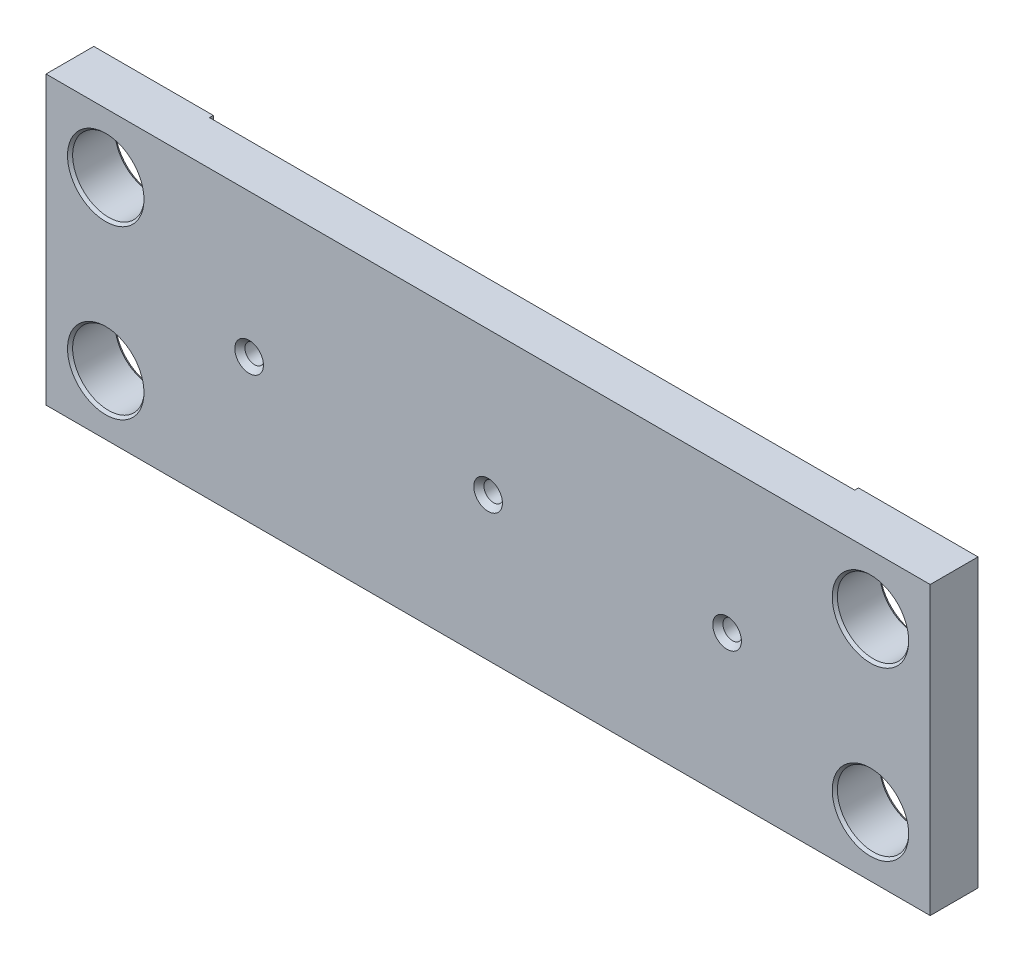
ISO-10303-21;
HEADER;
FILE_DESCRIPTION(('STEP AP214'),'2;1');
FILE_NAME('part.step','',(''),(''),'','','');
FILE_SCHEMA(('AUTOMOTIVE_DESIGN { 1 0 10303 214 1 1 1 1 }'));
ENDSEC;
DATA;
#1=APPLICATION_CONTEXT('core data for automotive mechanical design processes');
#2=APPLICATION_PROTOCOL_DEFINITION('international standard','automotive_design',2000,#1);
#3=PRODUCT_CONTEXT('',#1,'mechanical');
#4=PRODUCT('Part','Part','',(#3));
#5=PRODUCT_RELATED_PRODUCT_CATEGORY('part','',(#4));
#6=PRODUCT_DEFINITION_FORMATION('','',#4);
#7=PRODUCT_DEFINITION_CONTEXT('part definition',#1,'design');
#8=PRODUCT_DEFINITION('design','',#6,#7);
#9=PRODUCT_DEFINITION_SHAPE('','',#8);
#10=(LENGTH_UNIT() NAMED_UNIT(*) SI_UNIT(.MILLI.,.METRE.));
#11=(NAMED_UNIT(*) PLANE_ANGLE_UNIT() SI_UNIT($,.RADIAN.));
#12=(NAMED_UNIT(*) SI_UNIT($,.STERADIAN.) SOLID_ANGLE_UNIT());
#13=UNCERTAINTY_MEASURE_WITH_UNIT(LENGTH_MEASURE(1.E-05),#10,'distance_accuracy_value','');
#14=(GEOMETRIC_REPRESENTATION_CONTEXT(3) GLOBAL_UNCERTAINTY_ASSIGNED_CONTEXT((#13)) GLOBAL_UNIT_ASSIGNED_CONTEXT((#10,
#11,#12)) REPRESENTATION_CONTEXT('',''));
#15=CARTESIAN_POINT('',(0.,0.,0.));
#16=DIRECTION('',(0.,0.,1.));
#17=DIRECTION('',(1.,0.,0.));
#18=AXIS2_PLACEMENT_3D('',#15,#16,#17);
#19=CARTESIAN_POINT('',(-117.475,-38.1,0.));
#20=DIRECTION('',(0.,0.,1.));
#21=DIRECTION('',(1.,0.,0.));
#22=AXIS2_PLACEMENT_3D('',#19,#20,#21);
#23=PLANE('',#22);
#24=CARTESIAN_POINT('',(101.6,-22.225,0.));
#25=DIRECTION('',(0.,0.,1.));
#26=DIRECTION('',(1.,0.,0.));
#27=AXIS2_PLACEMENT_3D('',#24,#25,#26);
#28=CIRCLE('',#27,10.16);
#29=CARTESIAN_POINT('',(111.76,-22.225,0.));
#30=VERTEX_POINT('',#29);
#31=EDGE_CURVE('E189',#30,#30,#28,.T.);
#32=ORIENTED_EDGE('',*,*,#31,.T.);
#33=EDGE_LOOP('',(#32));
#34=FACE_BOUND('',#33,.T.);
#35=CARTESIAN_POINT('',(101.6,22.225,0.));
#36=DIRECTION('',(0.,0.,1.));
#37=DIRECTION('',(1.,0.,0.));
#38=AXIS2_PLACEMENT_3D('',#35,#36,#37);
#39=CIRCLE('',#38,10.16);
#40=CARTESIAN_POINT('',(111.76,22.225,0.));
#41=VERTEX_POINT('',#40);
#42=EDGE_CURVE('E177',#41,#41,#39,.T.);
#43=ORIENTED_EDGE('',*,*,#42,.T.);
#44=EDGE_LOOP('',(#43));
#45=FACE_BOUND('',#44,.T.);
#46=DIRECTION('',(1.,0.,0.));
#47=VECTOR('',#46,1.);
#48=CARTESIAN_POINT('',(-117.475,-38.1,0.));
#49=LINE('',#48,#47);
#50=CARTESIAN_POINT('',(85.725,-38.1,0.));
#51=VERTEX_POINT('',#50);
#52=CARTESIAN_POINT('',(117.475,-38.1,0.));
#53=VERTEX_POINT('',#52);
#54=EDGE_CURVE('E212',#51,#53,#49,.T.);
#55=ORIENTED_EDGE('',*,*,#54,.F.);
#56=DIRECTION('',(0.,-1.,0.));
#57=VECTOR('',#56,1.);
#58=CARTESIAN_POINT('',(85.725,38.1,0.));
#59=LINE('',#58,#57);
#60=CARTESIAN_POINT('',(85.725,38.1,0.));
#61=VERTEX_POINT('',#60);
#62=EDGE_CURVE('E123',#61,#51,#59,.T.);
#63=ORIENTED_EDGE('',*,*,#62,.F.);
#64=DIRECTION('',(-1.,0.,0.));
#65=VECTOR('',#64,1.);
#66=CARTESIAN_POINT('',(-117.475,38.1,0.));
#67=LINE('',#66,#65);
#68=CARTESIAN_POINT('',(117.475,38.1,0.));
#69=VERTEX_POINT('',#68);
#70=EDGE_CURVE('E204',#69,#61,#67,.T.);
#71=ORIENTED_EDGE('',*,*,#70,.F.);
#72=DIRECTION('',(0.,1.,0.));
#73=VECTOR('',#72,1.);
#74=CARTESIAN_POINT('',(117.475,38.1,0.));
#75=LINE('',#74,#73);
#76=EDGE_CURVE('E215',#53,#69,#75,.T.);
#77=ORIENTED_EDGE('',*,*,#76,.F.);
#78=EDGE_LOOP('',(#55,#63,#71,#77));
#79=FACE_BOUND('',#78,.T.);
#80=ADVANCED_FACE('F44',(#34,#45,#79),#23,.F.);
#81=CARTESIAN_POINT('',(-117.475,38.1,12.7));
#82=DIRECTION('',(1.,0.,0.));
#83=DIRECTION('',(0.,0.,-1.));
#84=AXIS2_PLACEMENT_3D('',#81,#82,#83);
#85=PLANE('',#84);
#86=DIRECTION('',(0.,-1.,0.));
#87=VECTOR('',#86,1.);
#88=CARTESIAN_POINT('',(-117.475,38.1,0.));
#89=LINE('',#88,#87);
#90=CARTESIAN_POINT('',(-117.475,38.1,0.));
#91=VERTEX_POINT('',#90);
#92=CARTESIAN_POINT('',(-117.475,-38.1,0.));
#93=VERTEX_POINT('',#92);
#94=EDGE_CURVE('E201',#91,#93,#89,.T.);
#95=ORIENTED_EDGE('',*,*,#94,.T.);
#96=DIRECTION('',(0.,0.,-1.));
#97=VECTOR('',#96,1.);
#98=CARTESIAN_POINT('',(-117.475,-38.1,12.7));
#99=LINE('',#98,#97);
#100=CARTESIAN_POINT('',(-117.475,-38.1,12.7));
#101=VERTEX_POINT('',#100);
#102=EDGE_CURVE('E13',#101,#93,#99,.T.);
#103=ORIENTED_EDGE('',*,*,#102,.F.);
#104=DIRECTION('',(0.,-1.,0.));
#105=VECTOR('',#104,1.);
#106=CARTESIAN_POINT('',(-117.475,38.1,12.7));
#107=LINE('',#106,#105);
#108=CARTESIAN_POINT('',(-117.475,38.1,12.7));
#109=VERTEX_POINT('',#108);
#110=EDGE_CURVE('E202',#109,#101,#107,.T.);
#111=ORIENTED_EDGE('',*,*,#110,.F.);
#112=DIRECTION('',(0.,0.,-1.));
#113=VECTOR('',#112,1.);
#114=CARTESIAN_POINT('',(-117.475,38.1,12.7));
#115=LINE('',#114,#113);
#116=EDGE_CURVE('E209',#109,#91,#115,.T.);
#117=ORIENTED_EDGE('',*,*,#116,.T.);
#118=EDGE_LOOP('',(#95,#103,#111,#117));
#119=FACE_BOUND('',#118,.T.);
#120=ADVANCED_FACE('F46',(#119),#85,.F.);
#121=CARTESIAN_POINT('',(-117.475,-38.1,12.7));
#122=DIRECTION('',(0.,1.,0.));
#123=DIRECTION('',(0.,0.,1.));
#124=AXIS2_PLACEMENT_3D('',#121,#122,#123);
#125=PLANE('',#124);
#126=DIRECTION('',(-1.,0.,0.));
#127=VECTOR('',#126,1.);
#128=CARTESIAN_POINT('',(85.725,-38.1,1.016));
#129=LINE('',#128,#127);
#130=CARTESIAN_POINT('',(85.725,-38.1,1.016));
#131=VERTEX_POINT('',#130);
#132=CARTESIAN_POINT('',(-85.725,-38.1,1.016));
#133=VERTEX_POINT('',#132);
#134=EDGE_CURVE('E132',#131,#133,#129,.T.);
#135=ORIENTED_EDGE('',*,*,#134,.F.);
#136=DIRECTION('',(0.,0.,-1.));
#137=VECTOR('',#136,1.);
#138=CARTESIAN_POINT('',(85.725,-38.1,1.016));
#139=LINE('',#138,#137);
#140=EDGE_CURVE('E117',#131,#51,#139,.T.);
#141=ORIENTED_EDGE('',*,*,#140,.T.);
#142=ORIENTED_EDGE('',*,*,#54,.T.);
#143=DIRECTION('',(0.,0.,-1.));
#144=VECTOR('',#143,1.);
#145=CARTESIAN_POINT('',(117.475,-38.1,12.7));
#146=LINE('',#145,#144);
#147=CARTESIAN_POINT('',(117.475,-38.1,12.7));
#148=VERTEX_POINT('',#147);
#149=EDGE_CURVE('E52',#148,#53,#146,.T.);
#150=ORIENTED_EDGE('',*,*,#149,.F.);
#151=DIRECTION('',(1.,0.,0.));
#152=VECTOR('',#151,1.);
#153=CARTESIAN_POINT('',(-117.475,-38.1,12.7));
#154=LINE('',#153,#152);
#155=EDGE_CURVE('E96',#101,#148,#154,.T.);
#156=ORIENTED_EDGE('',*,*,#155,.F.);
#157=ORIENTED_EDGE('',*,*,#102,.T.);
#158=CARTESIAN_POINT('',(-85.725,-38.1,0.));
#159=VERTEX_POINT('',#158);
#160=EDGE_CURVE('E213',#93,#159,#49,.T.);
#161=ORIENTED_EDGE('',*,*,#160,.T.);
#162=DIRECTION('',(0.,0.,-1.));
#163=VECTOR('',#162,1.);
#164=CARTESIAN_POINT('',(-85.725,-38.1,1.016));
#165=LINE('',#164,#163);
#166=EDGE_CURVE('E59',#133,#159,#165,.T.);
#167=ORIENTED_EDGE('',*,*,#166,.F.);
#168=EDGE_LOOP('',(#135,#141,#142,#150,#156,#157,#161,#167));
#169=FACE_BOUND('',#168,.T.);
#170=ADVANCED_FACE('F137',(#169),#125,.F.);
#171=CARTESIAN_POINT('',(117.475,38.1,12.7));
#172=DIRECTION('',(-1.,0.,0.));
#173=DIRECTION('',(0.,0.,1.));
#174=AXIS2_PLACEMENT_3D('',#171,#172,#173);
#175=PLANE('',#174);
#176=ORIENTED_EDGE('',*,*,#76,.T.);
#177=DIRECTION('',(0.,0.,-1.));
#178=VECTOR('',#177,1.);
#179=CARTESIAN_POINT('',(117.475,38.1,12.7));
#180=LINE('',#179,#178);
#181=CARTESIAN_POINT('',(117.475,38.1,12.7));
#182=VERTEX_POINT('',#181);
#183=EDGE_CURVE('E220',#182,#69,#180,.T.);
#184=ORIENTED_EDGE('',*,*,#183,.F.);
#185=DIRECTION('',(0.,1.,0.));
#186=VECTOR('',#185,1.);
#187=CARTESIAN_POINT('',(117.475,38.1,12.7));
#188=LINE('',#187,#186);
#189=EDGE_CURVE('E206',#148,#182,#188,.T.);
#190=ORIENTED_EDGE('',*,*,#189,.F.);
#191=ORIENTED_EDGE('',*,*,#149,.T.);
#192=EDGE_LOOP('',(#176,#184,#190,#191));
#193=FACE_BOUND('',#192,.T.);
#194=ADVANCED_FACE('F226',(#193),#175,.F.);
#195=CARTESIAN_POINT('',(-117.475,38.1,12.7));
#196=DIRECTION('',(0.,-1.,0.));
#197=DIRECTION('',(0.,0.,-1.));
#198=AXIS2_PLACEMENT_3D('',#195,#196,#197);
#199=PLANE('',#198);
#200=ORIENTED_EDGE('',*,*,#70,.T.);
#201=DIRECTION('',(0.,0.,-1.));
#202=VECTOR('',#201,1.);
#203=CARTESIAN_POINT('',(85.725,38.1,1.016));
#204=LINE('',#203,#202);
#205=CARTESIAN_POINT('',(85.725,38.1,1.016));
#206=VERTEX_POINT('',#205);
#207=EDGE_CURVE('E148',#206,#61,#204,.T.);
#208=ORIENTED_EDGE('',*,*,#207,.F.);
#209=DIRECTION('',(1.,0.,0.));
#210=VECTOR('',#209,1.);
#211=CARTESIAN_POINT('',(85.725,38.1,1.016));
#212=LINE('',#211,#210);
#213=CARTESIAN_POINT('',(-85.725,38.1,1.016));
#214=VERTEX_POINT('',#213);
#215=EDGE_CURVE('E126',#214,#206,#212,.T.);
#216=ORIENTED_EDGE('',*,*,#215,.F.);
#217=DIRECTION('',(0.,0.,-1.));
#218=VECTOR('',#217,1.);
#219=CARTESIAN_POINT('',(-85.725,38.1,1.016));
#220=LINE('',#219,#218);
#221=CARTESIAN_POINT('',(-85.725,38.1,0.));
#222=VERTEX_POINT('',#221);
#223=EDGE_CURVE('E151',#214,#222,#220,.T.);
#224=ORIENTED_EDGE('',*,*,#223,.T.);
#225=EDGE_CURVE('E89',#222,#91,#67,.T.);
#226=ORIENTED_EDGE('',*,*,#225,.T.);
#227=ORIENTED_EDGE('',*,*,#116,.F.);
#228=DIRECTION('',(-1.,0.,0.));
#229=VECTOR('',#228,1.);
#230=CARTESIAN_POINT('',(-117.475,38.1,12.7));
#231=LINE('',#230,#229);
#232=EDGE_CURVE('E68',#182,#109,#231,.T.);
#233=ORIENTED_EDGE('',*,*,#232,.F.);
#234=ORIENTED_EDGE('',*,*,#183,.T.);
#235=EDGE_LOOP('',(#200,#208,#216,#224,#226,#227,#233,#234));
#236=FACE_BOUND('',#235,.T.);
#237=ADVANCED_FACE('F230',(#236),#199,.F.);
#238=CARTESIAN_POINT('',(-117.475,-38.1,12.7));
#239=DIRECTION('',(0.,0.,1.));
#240=DIRECTION('',(1.,0.,0.));
#241=AXIS2_PLACEMENT_3D('',#238,#239,#240);
#242=PLANE('',#241);
#243=CARTESIAN_POINT('',(-63.5,0.,12.7));
#244=DIRECTION('',(0.,0.,1.));
#245=DIRECTION('',(1.,0.,0.));
#246=AXIS2_PLACEMENT_3D('',#243,#244,#245);
#247=CIRCLE('',#246,3.81);
#248=CARTESIAN_POINT('',(-59.69,0.,12.7));
#249=VERTEX_POINT('',#248);
#250=EDGE_CURVE('E568',#249,#249,#247,.T.);
#251=ORIENTED_EDGE('',*,*,#250,.F.);
#252=EDGE_LOOP('',(#251));
#253=FACE_BOUND('',#252,.T.);
#254=CARTESIAN_POINT('',(0.,0.,12.7));
#255=DIRECTION('',(0.,0.,1.));
#256=DIRECTION('',(1.,0.,0.));
#257=AXIS2_PLACEMENT_3D('',#254,#255,#256);
#258=CIRCLE('',#257,3.81);
#259=CARTESIAN_POINT('',(3.81,0.,12.7));
#260=VERTEX_POINT('',#259);
#261=EDGE_CURVE('E583',#260,#260,#258,.T.);
#262=ORIENTED_EDGE('',*,*,#261,.F.);
#263=EDGE_LOOP('',(#262));
#264=FACE_BOUND('',#263,.T.);
#265=CARTESIAN_POINT('',(63.5,0.,12.7));
#266=DIRECTION('',(0.,0.,1.));
#267=DIRECTION('',(1.,0.,0.));
#268=AXIS2_PLACEMENT_3D('',#265,#266,#267);
#269=CIRCLE('',#268,3.80999999999999);
#270=CARTESIAN_POINT('',(67.31,0.,12.7));
#271=VERTEX_POINT('',#270);
#272=EDGE_CURVE('E146',#271,#271,#269,.T.);
#273=ORIENTED_EDGE('',*,*,#272,.F.);
#274=EDGE_LOOP('',(#273));
#275=FACE_BOUND('',#274,.T.);
#276=CARTESIAN_POINT('',(-101.6,22.225,12.7));
#277=DIRECTION('',(0.,0.,1.));
#278=DIRECTION('',(1.,0.,0.));
#279=AXIS2_PLACEMENT_3D('',#276,#277,#278);
#280=CIRCLE('',#279,10.16);
#281=CARTESIAN_POINT('',(-91.44,22.225,12.7));
#282=VERTEX_POINT('',#281);
#283=EDGE_CURVE('E162',#282,#282,#280,.T.);
#284=ORIENTED_EDGE('',*,*,#283,.F.);
#285=EDGE_LOOP('',(#284));
#286=FACE_BOUND('',#285,.T.);
#287=CARTESIAN_POINT('',(-101.6,-22.225,12.7));
#288=DIRECTION('',(0.,0.,1.));
#289=DIRECTION('',(1.,0.,0.));
#290=AXIS2_PLACEMENT_3D('',#287,#288,#289);
#291=CIRCLE('',#290,10.16);
#292=CARTESIAN_POINT('',(-91.44,-22.225,12.7));
#293=VERTEX_POINT('',#292);
#294=EDGE_CURVE('E174',#293,#293,#291,.T.);
#295=ORIENTED_EDGE('',*,*,#294,.F.);
#296=EDGE_LOOP('',(#295));
#297=FACE_BOUND('',#296,.T.);
#298=CARTESIAN_POINT('',(101.6,22.225,12.7));
#299=DIRECTION('',(0.,0.,1.));
#300=DIRECTION('',(1.,0.,0.));
#301=AXIS2_PLACEMENT_3D('',#298,#299,#300);
#302=CIRCLE('',#301,10.16);
#303=CARTESIAN_POINT('',(111.76,22.225,12.7));
#304=VERTEX_POINT('',#303);
#305=EDGE_CURVE('E186',#304,#304,#302,.T.);
#306=ORIENTED_EDGE('',*,*,#305,.F.);
#307=EDGE_LOOP('',(#306));
#308=FACE_BOUND('',#307,.T.);
#309=CARTESIAN_POINT('',(101.6,-22.225,12.7));
#310=DIRECTION('',(0.,0.,1.));
#311=DIRECTION('',(1.,0.,0.));
#312=AXIS2_PLACEMENT_3D('',#309,#310,#311);
#313=CIRCLE('',#312,10.16);
#314=CARTESIAN_POINT('',(111.76,-22.225,12.7));
#315=VERTEX_POINT('',#314);
#316=EDGE_CURVE('E198',#315,#315,#313,.T.);
#317=ORIENTED_EDGE('',*,*,#316,.F.);
#318=EDGE_LOOP('',(#317));
#319=FACE_BOUND('',#318,.T.);
#320=ORIENTED_EDGE('',*,*,#110,.T.);
#321=ORIENTED_EDGE('',*,*,#155,.T.);
#322=ORIENTED_EDGE('',*,*,#189,.T.);
#323=ORIENTED_EDGE('',*,*,#232,.T.);
#324=EDGE_LOOP('',(#320,#321,#322,#323));
#325=FACE_BOUND('',#324,.T.);
#326=ADVANCED_FACE('F235',(#253,#264,#275,#286,#297,#308,#319,#325),#242,.T.);
#327=CARTESIAN_POINT('',(-101.6,22.225,0.));
#328=DIRECTION('',(0.,0.,1.));
#329=DIRECTION('',(1.,0.,0.));
#330=AXIS2_PLACEMENT_3D('',#327,#328,#329);
#331=CIRCLE('',#330,10.16);
#332=CARTESIAN_POINT('',(-91.44,22.225,0.));
#333=VERTEX_POINT('',#332);
#334=EDGE_CURVE('E150',#333,#333,#331,.T.);
#335=ORIENTED_EDGE('',*,*,#334,.T.);
#336=EDGE_LOOP('',(#335));
#337=FACE_BOUND('',#336,.T.);
#338=CARTESIAN_POINT('',(-101.6,-22.225,0.));
#339=DIRECTION('',(0.,0.,1.));
#340=DIRECTION('',(1.,0.,0.));
#341=AXIS2_PLACEMENT_3D('',#338,#339,#340);
#342=CIRCLE('',#341,10.16);
#343=CARTESIAN_POINT('',(-91.44,-22.225,0.));
#344=VERTEX_POINT('',#343);
#345=EDGE_CURVE('E165',#344,#344,#342,.T.);
#346=ORIENTED_EDGE('',*,*,#345,.T.);
#347=EDGE_LOOP('',(#346));
#348=FACE_BOUND('',#347,.T.);
#349=ORIENTED_EDGE('',*,*,#225,.F.);
#350=DIRECTION('',(0.,1.,0.));
#351=VECTOR('',#350,1.);
#352=CARTESIAN_POINT('',(-85.725,38.1,0.));
#353=LINE('',#352,#351);
#354=EDGE_CURVE('E135',#159,#222,#353,.T.);
#355=ORIENTED_EDGE('',*,*,#354,.F.);
#356=ORIENTED_EDGE('',*,*,#160,.F.);
#357=ORIENTED_EDGE('',*,*,#94,.F.);
#358=EDGE_LOOP('',(#349,#355,#356,#357));
#359=FACE_BOUND('',#358,.T.);
#360=ADVANCED_FACE('F237',(#337,#348,#359),#23,.F.);
#361=CARTESIAN_POINT('',(101.6,-22.225,12.7));
#362=DIRECTION('',(0.,0.,1.));
#363=DIRECTION('',(1.,0.,0.));
#364=AXIS2_PLACEMENT_3D('',#361,#362,#363);
#365=CONICAL_SURFACE('',#364,10.16,0.715584993317685);
#366=CARTESIAN_POINT('',(101.6,-22.225,11.9695160614147));
#367=DIRECTION('',(0.,0.,1.));
#368=DIRECTION('',(1.,0.,0.));
#369=AXIS2_PLACEMENT_3D('',#366,#367,#368);
#370=CIRCLE('',#369,9.52499999999999);
#371=CARTESIAN_POINT('',(111.125,-22.225,11.9695160614147));
#372=VERTEX_POINT('',#371);
#373=EDGE_CURVE('E195',#372,#372,#370,.T.);
#374=ORIENTED_EDGE('',*,*,#373,.F.);
#375=EDGE_LOOP('',(#374));
#376=FACE_BOUND('',#375,.T.);
#377=ORIENTED_EDGE('',*,*,#316,.T.);
#378=EDGE_LOOP('',(#377));
#379=FACE_BOUND('',#378,.T.);
#380=ADVANCED_FACE('F244',(#376,#379),#365,.F.);
#381=CARTESIAN_POINT('',(101.6,-22.225,12.7));
#382=DIRECTION('',(0.,0.,1.));
#383=DIRECTION('',(1.,0.,0.));
#384=AXIS2_PLACEMENT_3D('',#381,#382,#383);
#385=CYLINDRICAL_SURFACE('',#384,9.52499999999999);
#386=CARTESIAN_POINT('',(101.6,-22.225,0.730483938585342));
#387=DIRECTION('',(0.,0.,1.));
#388=DIRECTION('',(1.,0.,0.));
#389=AXIS2_PLACEMENT_3D('',#386,#387,#388);
#390=CIRCLE('',#389,9.52499999999999);
#391=CARTESIAN_POINT('',(111.125,-22.225,0.730483938585342));
#392=VERTEX_POINT('',#391);
#393=EDGE_CURVE('E192',#392,#392,#390,.T.);
#394=ORIENTED_EDGE('',*,*,#393,.F.);
#395=EDGE_LOOP('',(#394));
#396=FACE_BOUND('',#395,.T.);
#397=ORIENTED_EDGE('',*,*,#373,.T.);
#398=EDGE_LOOP('',(#397));
#399=FACE_BOUND('',#398,.T.);
#400=ADVANCED_FACE('F448',(#396,#399),#385,.F.);
#401=CARTESIAN_POINT('',(101.6,-22.225,0.730483938585342));
#402=DIRECTION('',(0.,0.,-1.));
#403=DIRECTION('',(-1.,0.,0.));
#404=AXIS2_PLACEMENT_3D('',#401,#402,#403);
#405=CONICAL_SURFACE('',#404,9.52499999999999,0.715584993317683);
#406=ORIENTED_EDGE('',*,*,#31,.F.);
#407=EDGE_LOOP('',(#406));
#408=FACE_BOUND('',#407,.T.);
#409=ORIENTED_EDGE('',*,*,#393,.T.);
#410=EDGE_LOOP('',(#409));
#411=FACE_BOUND('',#410,.T.);
#412=ADVANCED_FACE('F444',(#408,#411),#405,.F.);
#413=CARTESIAN_POINT('',(101.6,22.225,12.7));
#414=DIRECTION('',(0.,0.,1.));
#415=DIRECTION('',(1.,0.,0.));
#416=AXIS2_PLACEMENT_3D('',#413,#414,#415);
#417=CONICAL_SURFACE('',#416,10.16,0.715584993317685);
#418=CARTESIAN_POINT('',(101.6,22.225,11.9695160614147));
#419=DIRECTION('',(0.,0.,1.));
#420=DIRECTION('',(1.,0.,0.));
#421=AXIS2_PLACEMENT_3D('',#418,#419,#420);
#422=CIRCLE('',#421,9.52499999999999);
#423=CARTESIAN_POINT('',(111.125,22.225,11.9695160614147));
#424=VERTEX_POINT('',#423);
#425=EDGE_CURVE('E183',#424,#424,#422,.T.);
#426=ORIENTED_EDGE('',*,*,#425,.F.);
#427=EDGE_LOOP('',(#426));
#428=FACE_BOUND('',#427,.T.);
#429=ORIENTED_EDGE('',*,*,#305,.T.);
#430=EDGE_LOOP('',(#429));
#431=FACE_BOUND('',#430,.T.);
#432=ADVANCED_FACE('F440',(#428,#431),#417,.F.);
#433=CARTESIAN_POINT('',(101.6,22.225,12.7));
#434=DIRECTION('',(0.,0.,1.));
#435=DIRECTION('',(1.,0.,0.));
#436=AXIS2_PLACEMENT_3D('',#433,#434,#435);
#437=CYLINDRICAL_SURFACE('',#436,9.52499999999999);
#438=CARTESIAN_POINT('',(101.6,22.225,0.730483938585342));
#439=DIRECTION('',(0.,0.,1.));
#440=DIRECTION('',(1.,0.,0.));
#441=AXIS2_PLACEMENT_3D('',#438,#439,#440);
#442=CIRCLE('',#441,9.52499999999999);
#443=CARTESIAN_POINT('',(111.125,22.225,0.730483938585342));
#444=VERTEX_POINT('',#443);
#445=EDGE_CURVE('E180',#444,#444,#442,.T.);
#446=ORIENTED_EDGE('',*,*,#445,.F.);
#447=EDGE_LOOP('',(#446));
#448=FACE_BOUND('',#447,.T.);
#449=ORIENTED_EDGE('',*,*,#425,.T.);
#450=EDGE_LOOP('',(#449));
#451=FACE_BOUND('',#450,.T.);
#452=ADVANCED_FACE('F436',(#448,#451),#437,.F.);
#453=CARTESIAN_POINT('',(101.6,22.225,0.730483938585342));
#454=DIRECTION('',(0.,0.,-1.));
#455=DIRECTION('',(-1.,0.,0.));
#456=AXIS2_PLACEMENT_3D('',#453,#454,#455);
#457=CONICAL_SURFACE('',#456,9.52499999999999,0.715584993317683);
#458=ORIENTED_EDGE('',*,*,#42,.F.);
#459=EDGE_LOOP('',(#458));
#460=FACE_BOUND('',#459,.T.);
#461=ORIENTED_EDGE('',*,*,#445,.T.);
#462=EDGE_LOOP('',(#461));
#463=FACE_BOUND('',#462,.T.);
#464=ADVANCED_FACE('F432',(#460,#463),#457,.F.);
#465=CARTESIAN_POINT('',(-101.6,-22.225,12.7));
#466=DIRECTION('',(0.,0.,1.));
#467=DIRECTION('',(1.,0.,0.));
#468=AXIS2_PLACEMENT_3D('',#465,#466,#467);
#469=CONICAL_SURFACE('',#468,10.16,0.715584993317685);
#470=CARTESIAN_POINT('',(-101.6,-22.225,11.9695160614147));
#471=DIRECTION('',(0.,0.,1.));
#472=DIRECTION('',(1.,0.,0.));
#473=AXIS2_PLACEMENT_3D('',#470,#471,#472);
#474=CIRCLE('',#473,9.52499999999999);
#475=CARTESIAN_POINT('',(-92.075,-22.225,11.9695160614147));
#476=VERTEX_POINT('',#475);
#477=EDGE_CURVE('E171',#476,#476,#474,.T.);
#478=ORIENTED_EDGE('',*,*,#477,.F.);
#479=EDGE_LOOP('',(#478));
#480=FACE_BOUND('',#479,.T.);
#481=ORIENTED_EDGE('',*,*,#294,.T.);
#482=EDGE_LOOP('',(#481));
#483=FACE_BOUND('',#482,.T.);
#484=ADVANCED_FACE('F428',(#480,#483),#469,.F.);
#485=CARTESIAN_POINT('',(-101.6,-22.225,12.7));
#486=DIRECTION('',(0.,0.,1.));
#487=DIRECTION('',(1.,0.,0.));
#488=AXIS2_PLACEMENT_3D('',#485,#486,#487);
#489=CYLINDRICAL_SURFACE('',#488,9.52499999999999);
#490=CARTESIAN_POINT('',(-101.6,-22.225,0.730483938585342));
#491=DIRECTION('',(0.,0.,1.));
#492=DIRECTION('',(1.,0.,0.));
#493=AXIS2_PLACEMENT_3D('',#490,#491,#492);
#494=CIRCLE('',#493,9.52499999999999);
#495=CARTESIAN_POINT('',(-92.075,-22.225,0.730483938585342));
#496=VERTEX_POINT('',#495);
#497=EDGE_CURVE('E168',#496,#496,#494,.T.);
#498=ORIENTED_EDGE('',*,*,#497,.F.);
#499=EDGE_LOOP('',(#498));
#500=FACE_BOUND('',#499,.T.);
#501=ORIENTED_EDGE('',*,*,#477,.T.);
#502=EDGE_LOOP('',(#501));
#503=FACE_BOUND('',#502,.T.);
#504=ADVANCED_FACE('F424',(#500,#503),#489,.F.);
#505=CARTESIAN_POINT('',(-101.6,-22.225,0.730483938585342));
#506=DIRECTION('',(0.,0.,-1.));
#507=DIRECTION('',(-1.,0.,0.));
#508=AXIS2_PLACEMENT_3D('',#505,#506,#507);
#509=CONICAL_SURFACE('',#508,9.52499999999999,0.715584993317683);
#510=ORIENTED_EDGE('',*,*,#345,.F.);
#511=EDGE_LOOP('',(#510));
#512=FACE_BOUND('',#511,.T.);
#513=ORIENTED_EDGE('',*,*,#497,.T.);
#514=EDGE_LOOP('',(#513));
#515=FACE_BOUND('',#514,.T.);
#516=ADVANCED_FACE('F420',(#512,#515),#509,.F.);
#517=CARTESIAN_POINT('',(-101.6,22.225,12.7));
#518=DIRECTION('',(0.,0.,1.));
#519=DIRECTION('',(1.,0.,0.));
#520=AXIS2_PLACEMENT_3D('',#517,#518,#519);
#521=CONICAL_SURFACE('',#520,10.16,0.715584993317685);
#522=CARTESIAN_POINT('',(-101.6,22.225,11.9695160614147));
#523=DIRECTION('',(0.,0.,1.));
#524=DIRECTION('',(1.,0.,0.));
#525=AXIS2_PLACEMENT_3D('',#522,#523,#524);
#526=CIRCLE('',#525,9.52499999999999);
#527=CARTESIAN_POINT('',(-92.075,22.225,11.9695160614147));
#528=VERTEX_POINT('',#527);
#529=EDGE_CURVE('E159',#528,#528,#526,.T.);
#530=ORIENTED_EDGE('',*,*,#529,.F.);
#531=EDGE_LOOP('',(#530));
#532=FACE_BOUND('',#531,.T.);
#533=ORIENTED_EDGE('',*,*,#283,.T.);
#534=EDGE_LOOP('',(#533));
#535=FACE_BOUND('',#534,.T.);
#536=ADVANCED_FACE('F416',(#532,#535),#521,.F.);
#537=CARTESIAN_POINT('',(-101.6,22.225,12.7));
#538=DIRECTION('',(0.,0.,1.));
#539=DIRECTION('',(1.,0.,0.));
#540=AXIS2_PLACEMENT_3D('',#537,#538,#539);
#541=CYLINDRICAL_SURFACE('',#540,9.52499999999999);
#542=CARTESIAN_POINT('',(-101.6,22.225,0.730483938585342));
#543=DIRECTION('',(0.,0.,1.));
#544=DIRECTION('',(1.,0.,0.));
#545=AXIS2_PLACEMENT_3D('',#542,#543,#544);
#546=CIRCLE('',#545,9.52499999999999);
#547=CARTESIAN_POINT('',(-92.075,22.225,0.730483938585342));
#548=VERTEX_POINT('',#547);
#549=EDGE_CURVE('E156',#548,#548,#546,.T.);
#550=ORIENTED_EDGE('',*,*,#549,.F.);
#551=EDGE_LOOP('',(#550));
#552=FACE_BOUND('',#551,.T.);
#553=ORIENTED_EDGE('',*,*,#529,.T.);
#554=EDGE_LOOP('',(#553));
#555=FACE_BOUND('',#554,.T.);
#556=ADVANCED_FACE('F412',(#552,#555),#541,.F.);
#557=CARTESIAN_POINT('',(-101.6,22.225,0.730483938585342));
#558=DIRECTION('',(0.,0.,-1.));
#559=DIRECTION('',(-1.,0.,0.));
#560=AXIS2_PLACEMENT_3D('',#557,#558,#559);
#561=CONICAL_SURFACE('',#560,9.52499999999999,0.715584993317683);
#562=ORIENTED_EDGE('',*,*,#334,.F.);
#563=EDGE_LOOP('',(#562));
#564=FACE_BOUND('',#563,.T.);
#565=ORIENTED_EDGE('',*,*,#549,.T.);
#566=EDGE_LOOP('',(#565));
#567=FACE_BOUND('',#566,.T.);
#568=ADVANCED_FACE('F292',(#564,#567),#561,.F.);
#569=CARTESIAN_POINT('',(85.725,38.1,1.016));
#570=DIRECTION('',(1.,0.,0.));
#571=DIRECTION('',(0.,1.,0.));
#572=AXIS2_PLACEMENT_3D('',#569,#570,#571);
#573=PLANE('',#572);
#574=ORIENTED_EDGE('',*,*,#62,.T.);
#575=ORIENTED_EDGE('',*,*,#140,.F.);
#576=DIRECTION('',(0.,-1.,0.));
#577=VECTOR('',#576,1.);
#578=CARTESIAN_POINT('',(85.725,38.1,1.016));
#579=LINE('',#578,#577);
#580=EDGE_CURVE('E120',#206,#131,#579,.T.);
#581=ORIENTED_EDGE('',*,*,#580,.F.);
#582=ORIENTED_EDGE('',*,*,#207,.T.);
#583=EDGE_LOOP('',(#574,#575,#581,#582));
#584=FACE_BOUND('',#583,.T.);
#585=ADVANCED_FACE('F119',(#584),#573,.F.);
#586=CARTESIAN_POINT('',(-85.725,38.1,1.016));
#587=DIRECTION('',(-1.,0.,0.));
#588=DIRECTION('',(0.,-1.,0.));
#589=AXIS2_PLACEMENT_3D('',#586,#587,#588);
#590=PLANE('',#589);
#591=ORIENTED_EDGE('',*,*,#354,.T.);
#592=ORIENTED_EDGE('',*,*,#223,.F.);
#593=DIRECTION('',(0.,1.,0.));
#594=VECTOR('',#593,1.);
#595=CARTESIAN_POINT('',(-85.725,38.1,1.016));
#596=LINE('',#595,#594);
#597=EDGE_CURVE('E139',#133,#214,#596,.T.);
#598=ORIENTED_EDGE('',*,*,#597,.F.);
#599=ORIENTED_EDGE('',*,*,#166,.T.);
#600=EDGE_LOOP('',(#591,#592,#598,#599));
#601=FACE_BOUND('',#600,.T.);
#602=ADVANCED_FACE('F291',(#601),#590,.F.);
#603=CARTESIAN_POINT('',(85.725,-38.1,1.016));
#604=DIRECTION('',(0.,0.,-1.));
#605=DIRECTION('',(-1.,0.,0.));
#606=AXIS2_PLACEMENT_3D('',#603,#604,#605);
#607=PLANE('',#606);
#608=CARTESIAN_POINT('',(-63.5,0.,1.016));
#609=DIRECTION('',(0.,0.,1.));
#610=DIRECTION('',(1.,0.,0.));
#611=AXIS2_PLACEMENT_3D('',#608,#609,#610);
#612=CIRCLE('',#611,3.80999999999999);
#613=CARTESIAN_POINT('',(-59.69,0.,1.016));
#614=VERTEX_POINT('',#613);
#615=EDGE_CURVE('E561',#614,#614,#612,.T.);
#616=ORIENTED_EDGE('',*,*,#615,.T.);
#617=EDGE_LOOP('',(#616));
#618=FACE_BOUND('',#617,.T.);
#619=CARTESIAN_POINT('',(0.,0.,1.016));
#620=DIRECTION('',(0.,0.,1.));
#621=DIRECTION('',(1.,0.,0.));
#622=AXIS2_PLACEMENT_3D('',#619,#620,#621);
#623=CIRCLE('',#622,3.81);
#624=CARTESIAN_POINT('',(3.81,0.,1.016));
#625=VERTEX_POINT('',#624);
#626=EDGE_CURVE('E574',#625,#625,#623,.T.);
#627=ORIENTED_EDGE('',*,*,#626,.T.);
#628=EDGE_LOOP('',(#627));
#629=FACE_BOUND('',#628,.T.);
#630=CARTESIAN_POINT('',(63.5,0.,1.016));
#631=DIRECTION('',(0.,0.,1.));
#632=DIRECTION('',(1.,0.,0.));
#633=AXIS2_PLACEMENT_3D('',#630,#631,#632);
#634=CIRCLE('',#633,3.80999999999999);
#635=CARTESIAN_POINT('',(67.31,0.,1.016));
#636=VERTEX_POINT('',#635);
#637=EDGE_CURVE('E586',#636,#636,#634,.T.);
#638=ORIENTED_EDGE('',*,*,#637,.T.);
#639=EDGE_LOOP('',(#638));
#640=FACE_BOUND('',#639,.T.);
#641=ORIENTED_EDGE('',*,*,#580,.T.);
#642=ORIENTED_EDGE('',*,*,#134,.T.);
#643=ORIENTED_EDGE('',*,*,#597,.T.);
#644=ORIENTED_EDGE('',*,*,#215,.T.);
#645=EDGE_LOOP('',(#641,#642,#643,#644));
#646=FACE_BOUND('',#645,.T.);
#647=ADVANCED_FACE('F130',(#618,#629,#640,#646),#607,.T.);
#648=CARTESIAN_POINT('',(63.5,0.,12.7));
#649=DIRECTION('',(0.,0.,1.));
#650=DIRECTION('',(1.,0.,0.));
#651=AXIS2_PLACEMENT_3D('',#648,#649,#650);
#652=CONICAL_SURFACE('',#651,3.80999999999999,0.715584993317671);
#653=CARTESIAN_POINT('',(63.5,0.,11.253641801601));
#654=DIRECTION('',(0.,0.,1.));
#655=DIRECTION('',(1.,0.,0.));
#656=AXIS2_PLACEMENT_3D('',#653,#654,#655);
#657=CIRCLE('',#656,2.55270000000001);
#658=CARTESIAN_POINT('',(66.0527,0.,11.253641801601));
#659=VERTEX_POINT('',#658);
#660=EDGE_CURVE('E592',#659,#659,#657,.T.);
#661=ORIENTED_EDGE('',*,*,#660,.F.);
#662=EDGE_LOOP('',(#661));
#663=FACE_BOUND('',#662,.T.);
#664=ORIENTED_EDGE('',*,*,#272,.T.);
#665=EDGE_LOOP('',(#664));
#666=FACE_BOUND('',#665,.T.);
#667=ADVANCED_FACE('F314',(#663,#666),#652,.F.);
#668=CARTESIAN_POINT('',(63.5,0.,12.7));
#669=DIRECTION('',(0.,0.,1.));
#670=DIRECTION('',(1.,0.,0.));
#671=AXIS2_PLACEMENT_3D('',#668,#669,#670);
#672=CYLINDRICAL_SURFACE('',#671,2.5527);
#673=CARTESIAN_POINT('',(63.5,0.,2.46235819839897));
#674=DIRECTION('',(0.,0.,1.));
#675=DIRECTION('',(1.,0.,0.));
#676=AXIS2_PLACEMENT_3D('',#673,#674,#675);
#677=CIRCLE('',#676,2.55269999999999);
#678=CARTESIAN_POINT('',(66.0527,0.,2.46235819839897));
#679=VERTEX_POINT('',#678);
#680=EDGE_CURVE('E589',#679,#679,#677,.T.);
#681=ORIENTED_EDGE('',*,*,#680,.F.);
#682=EDGE_LOOP('',(#681));
#683=FACE_BOUND('',#682,.T.);
#684=ORIENTED_EDGE('',*,*,#660,.T.);
#685=EDGE_LOOP('',(#684));
#686=FACE_BOUND('',#685,.T.);
#687=ADVANCED_FACE('F324',(#683,#686),#672,.F.);
#688=CARTESIAN_POINT('',(63.5,0.,2.46235819839897));
#689=DIRECTION('',(0.,0.,-1.));
#690=DIRECTION('',(-1.,0.,0.));
#691=AXIS2_PLACEMENT_3D('',#688,#689,#690);
#692=CONICAL_SURFACE('',#691,2.55269999999999,0.715584993317678);
#693=ORIENTED_EDGE('',*,*,#637,.F.);
#694=EDGE_LOOP('',(#693));
#695=FACE_BOUND('',#694,.T.);
#696=ORIENTED_EDGE('',*,*,#680,.T.);
#697=EDGE_LOOP('',(#696));
#698=FACE_BOUND('',#697,.T.);
#699=ADVANCED_FACE('F334',(#695,#698),#692,.F.);
#700=CARTESIAN_POINT('',(0.,0.,12.7));
#701=DIRECTION('',(0.,0.,1.));
#702=DIRECTION('',(1.,0.,0.));
#703=AXIS2_PLACEMENT_3D('',#700,#701,#702);
#704=CONICAL_SURFACE('',#703,3.81,0.715584993317675);
#705=CARTESIAN_POINT('',(0.,0.,11.253641801601));
#706=DIRECTION('',(0.,0.,1.));
#707=DIRECTION('',(1.,0.,0.));
#708=AXIS2_PLACEMENT_3D('',#705,#706,#707);
#709=CIRCLE('',#708,2.5527);
#710=CARTESIAN_POINT('',(2.5527,0.,11.253641801601));
#711=VERTEX_POINT('',#710);
#712=EDGE_CURVE('E580',#711,#711,#709,.T.);
#713=ORIENTED_EDGE('',*,*,#712,.F.);
#714=EDGE_LOOP('',(#713));
#715=FACE_BOUND('',#714,.T.);
#716=ORIENTED_EDGE('',*,*,#261,.T.);
#717=EDGE_LOOP('',(#716));
#718=FACE_BOUND('',#717,.T.);
#719=ADVANCED_FACE('F344',(#715,#718),#704,.F.);
#720=CARTESIAN_POINT('',(0.,0.,12.7));
#721=DIRECTION('',(0.,0.,1.));
#722=DIRECTION('',(1.,0.,0.));
#723=AXIS2_PLACEMENT_3D('',#720,#721,#722);
#724=CYLINDRICAL_SURFACE('',#723,2.5527);
#725=CARTESIAN_POINT('',(0.,0.,2.46235819839897));
#726=DIRECTION('',(0.,0.,1.));
#727=DIRECTION('',(1.,0.,0.));
#728=AXIS2_PLACEMENT_3D('',#725,#726,#727);
#729=CIRCLE('',#728,2.5527);
#730=CARTESIAN_POINT('',(2.5527,0.,2.46235819839897));
#731=VERTEX_POINT('',#730);
#732=EDGE_CURVE('E577',#731,#731,#729,.T.);
#733=ORIENTED_EDGE('',*,*,#732,.F.);
#734=EDGE_LOOP('',(#733));
#735=FACE_BOUND('',#734,.T.);
#736=ORIENTED_EDGE('',*,*,#712,.T.);
#737=EDGE_LOOP('',(#736));
#738=FACE_BOUND('',#737,.T.);
#739=ADVANCED_FACE('F354',(#735,#738),#724,.F.);
#740=CARTESIAN_POINT('',(0.,0.,2.46235819839897));
#741=DIRECTION('',(0.,0.,-1.));
#742=DIRECTION('',(-1.,0.,0.));
#743=AXIS2_PLACEMENT_3D('',#740,#741,#742);
#744=CONICAL_SURFACE('',#743,2.5527,0.715584993317677);
#745=ORIENTED_EDGE('',*,*,#626,.F.);
#746=EDGE_LOOP('',(#745));
#747=FACE_BOUND('',#746,.T.);
#748=ORIENTED_EDGE('',*,*,#732,.T.);
#749=EDGE_LOOP('',(#748));
#750=FACE_BOUND('',#749,.T.);
#751=ADVANCED_FACE('F364',(#747,#750),#744,.F.);
#752=CARTESIAN_POINT('',(-63.5,0.,12.7));
#753=DIRECTION('',(0.,0.,1.));
#754=DIRECTION('',(1.,0.,0.));
#755=AXIS2_PLACEMENT_3D('',#752,#753,#754);
#756=CONICAL_SURFACE('',#755,3.81,0.715584993317676);
#757=CARTESIAN_POINT('',(-63.5,0.,11.253641801601));
#758=DIRECTION('',(0.,0.,1.));
#759=DIRECTION('',(1.,0.,0.));
#760=AXIS2_PLACEMENT_3D('',#757,#758,#759);
#761=CIRCLE('',#760,2.5527);
#762=CARTESIAN_POINT('',(-60.9473,0.,11.253641801601));
#763=VERTEX_POINT('',#762);
#764=EDGE_CURVE('E565',#763,#763,#761,.T.);
#765=ORIENTED_EDGE('',*,*,#764,.F.);
#766=EDGE_LOOP('',(#765));
#767=FACE_BOUND('',#766,.T.);
#768=ORIENTED_EDGE('',*,*,#250,.T.);
#769=EDGE_LOOP('',(#768));
#770=FACE_BOUND('',#769,.T.);
#771=ADVANCED_FACE('F374',(#767,#770),#756,.F.);
#772=CARTESIAN_POINT('',(-63.5,0.,12.7));
#773=DIRECTION('',(0.,0.,1.));
#774=DIRECTION('',(1.,0.,0.));
#775=AXIS2_PLACEMENT_3D('',#772,#773,#774);
#776=CYLINDRICAL_SURFACE('',#775,2.5527);
#777=CARTESIAN_POINT('',(-63.5,0.,2.46235819839897));
#778=DIRECTION('',(0.,0.,1.));
#779=DIRECTION('',(1.,0.,0.));
#780=AXIS2_PLACEMENT_3D('',#777,#778,#779);
#781=CIRCLE('',#780,2.5527);
#782=CARTESIAN_POINT('',(-60.9473,0.,2.46235819839897));
#783=VERTEX_POINT('',#782);
#784=EDGE_CURVE('E564',#783,#783,#781,.T.);
#785=ORIENTED_EDGE('',*,*,#784,.F.);
#786=EDGE_LOOP('',(#785));
#787=FACE_BOUND('',#786,.T.);
#788=ORIENTED_EDGE('',*,*,#764,.T.);
#789=EDGE_LOOP('',(#788));
#790=FACE_BOUND('',#789,.T.);
#791=ADVANCED_FACE('F384',(#787,#790),#776,.F.);
#792=CARTESIAN_POINT('',(-63.5,0.,2.46235819839897));
#793=DIRECTION('',(0.,0.,-1.));
#794=DIRECTION('',(-1.,0.,0.));
#795=AXIS2_PLACEMENT_3D('',#792,#793,#794);
#796=CONICAL_SURFACE('',#795,2.5527,0.715584993317675);
#797=ORIENTED_EDGE('',*,*,#615,.F.);
#798=EDGE_LOOP('',(#797));
#799=FACE_BOUND('',#798,.T.);
#800=ORIENTED_EDGE('',*,*,#784,.T.);
#801=EDGE_LOOP('',(#800));
#802=FACE_BOUND('',#801,.T.);
#803=ADVANCED_FACE('F394',(#799,#802),#796,.F.);
#804=CLOSED_SHELL('',(#80,#120,#170,#194,#237,#326,#360,#380,#400,#412,#432,#452,#464,#484,#504,
#516,#536,#556,#568,#585,#602,#647,#667,#687,#699,#719,#739,#751,#771,#791,#803));
#805=MANIFOLD_SOLID_BREP('B2',#804);
#806=ADVANCED_BREP_SHAPE_REPRESENTATION('',(#18,#805),#14);
#807=SHAPE_DEFINITION_REPRESENTATION(#9,#806);
ENDSEC;
END-ISO-10303-21;
